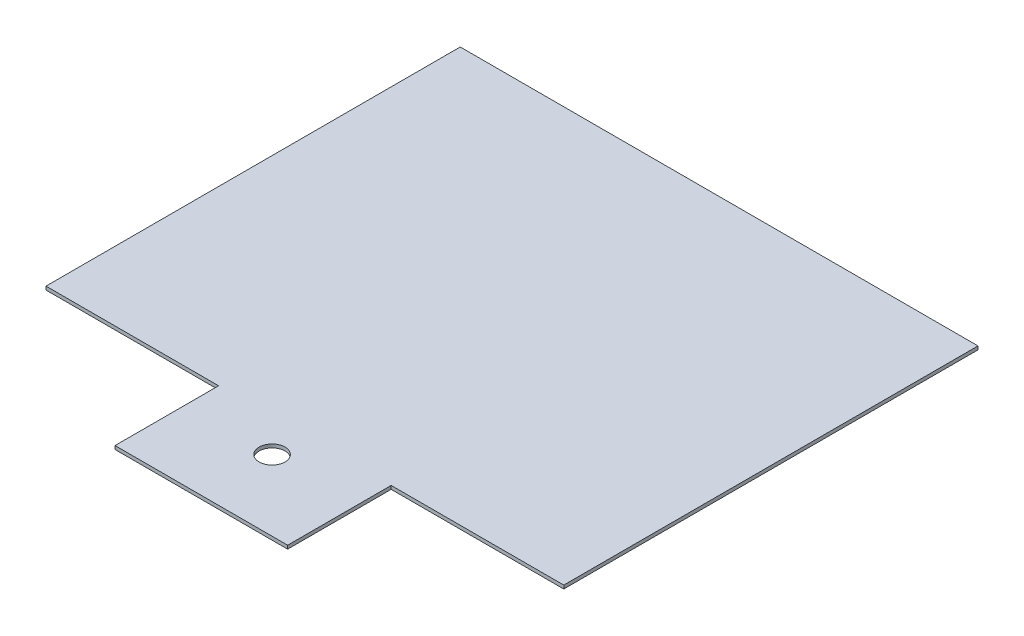
ISO-10303-21;
HEADER;
FILE_DESCRIPTION(('STEP AP214'),'2;1');
FILE_NAME('part.step','',(''),(''),'','','');
FILE_SCHEMA(('AUTOMOTIVE_DESIGN { 1 0 10303 214 1 1 1 1 }'));
ENDSEC;
DATA;
#1=APPLICATION_CONTEXT('core data for automotive mechanical design processes');
#2=APPLICATION_PROTOCOL_DEFINITION('international standard','automotive_design',2000,#1);
#3=PRODUCT_CONTEXT('',#1,'mechanical');
#4=PRODUCT('Part','Part','',(#3));
#5=PRODUCT_RELATED_PRODUCT_CATEGORY('part','',(#4));
#6=PRODUCT_DEFINITION_FORMATION('','',#4);
#7=PRODUCT_DEFINITION_CONTEXT('part definition',#1,'design');
#8=PRODUCT_DEFINITION('design','',#6,#7);
#9=PRODUCT_DEFINITION_SHAPE('','',#8);
#10=(LENGTH_UNIT() NAMED_UNIT(*) SI_UNIT(.MILLI.,.METRE.));
#11=(NAMED_UNIT(*) PLANE_ANGLE_UNIT() SI_UNIT($,.RADIAN.));
#12=(NAMED_UNIT(*) SI_UNIT($,.STERADIAN.) SOLID_ANGLE_UNIT());
#13=UNCERTAINTY_MEASURE_WITH_UNIT(LENGTH_MEASURE(1.E-05),#10,'distance_accuracy_value','');
#14=(GEOMETRIC_REPRESENTATION_CONTEXT(3) GLOBAL_UNCERTAINTY_ASSIGNED_CONTEXT((#13)) GLOBAL_UNIT_ASSIGNED_CONTEXT((#10,
#11,#12)) REPRESENTATION_CONTEXT('',''));
#15=CARTESIAN_POINT('',(0.,0.,0.));
#16=DIRECTION('',(0.,0.,1.));
#17=DIRECTION('',(1.,0.,0.));
#18=AXIS2_PLACEMENT_3D('',#15,#16,#17);
#19=CARTESIAN_POINT('',(-50.,2.,-250.));
#20=DIRECTION('',(0.,0.,1.));
#21=DIRECTION('',(1.,0.,0.));
#22=AXIS2_PLACEMENT_3D('',#19,#20,#21);
#23=PLANE('',#22);
#24=DIRECTION('',(-1.,0.,0.));
#25=VECTOR('',#24,1.);
#26=CARTESIAN_POINT('',(-50.,0.,-250.));
#27=LINE('',#26,#25);
#28=CARTESIAN_POINT('',(150.,0.,-250.));
#29=VERTEX_POINT('',#28);
#30=CARTESIAN_POINT('',(-150.,0.,-250.));
#31=VERTEX_POINT('',#30);
#32=EDGE_CURVE('E85',#29,#31,#27,.T.);
#33=ORIENTED_EDGE('',*,*,#32,.T.);
#34=DIRECTION('',(0.,-1.,0.));
#35=VECTOR('',#34,1.);
#36=CARTESIAN_POINT('',(-150.,2.,-250.));
#37=LINE('',#36,#35);
#38=CARTESIAN_POINT('',(-150.,2.,-250.));
#39=VERTEX_POINT('',#38);
#40=EDGE_CURVE('E11',#39,#31,#37,.T.);
#41=ORIENTED_EDGE('',*,*,#40,.F.);
#42=DIRECTION('',(-1.,0.,0.));
#43=VECTOR('',#42,1.);
#44=CARTESIAN_POINT('',(150.,2.,-250.));
#45=LINE('',#44,#43);
#46=CARTESIAN_POINT('',(150.,2.,-250.));
#47=VERTEX_POINT('',#46);
#48=EDGE_CURVE('E91',#47,#39,#45,.T.);
#49=ORIENTED_EDGE('',*,*,#48,.F.);
#50=DIRECTION('',(0.,-1.,0.));
#51=VECTOR('',#50,1.);
#52=CARTESIAN_POINT('',(150.,2.,-250.));
#53=LINE('',#52,#51);
#54=EDGE_CURVE('E125',#47,#29,#53,.T.);
#55=ORIENTED_EDGE('',*,*,#54,.T.);
#56=EDGE_LOOP('',(#33,#41,#49,#55));
#57=FACE_BOUND('',#56,.T.);
#58=ADVANCED_FACE('F33',(#57),#23,.F.);
#59=CARTESIAN_POINT('',(-150.,2.,-250.));
#60=DIRECTION('',(1.,0.,0.));
#61=DIRECTION('',(0.,0.,-1.));
#62=AXIS2_PLACEMENT_3D('',#59,#60,#61);
#63=PLANE('',#62);
#64=DIRECTION('',(0.,0.,1.));
#65=VECTOR('',#64,1.);
#66=CARTESIAN_POINT('',(-150.,0.,-250.));
#67=LINE('',#66,#65);
#68=CARTESIAN_POINT('',(-150.,0.,-9.99999999999995));
#69=VERTEX_POINT('',#68);
#70=EDGE_CURVE('E130',#31,#69,#67,.T.);
#71=ORIENTED_EDGE('',*,*,#70,.T.);
#72=DIRECTION('',(0.,-1.,0.));
#73=VECTOR('',#72,1.);
#74=CARTESIAN_POINT('',(-150.,2.,-9.99999999999995));
#75=LINE('',#74,#73);
#76=CARTESIAN_POINT('',(-150.,2.,-9.99999999999995));
#77=VERTEX_POINT('',#76);
#78=EDGE_CURVE('E41',#77,#69,#75,.T.);
#79=ORIENTED_EDGE('',*,*,#78,.F.);
#80=DIRECTION('',(0.,0.,1.));
#81=VECTOR('',#80,1.);
#82=CARTESIAN_POINT('',(-150.,2.,-250.));
#83=LINE('',#82,#81);
#84=EDGE_CURVE('E175',#39,#77,#83,.T.);
#85=ORIENTED_EDGE('',*,*,#84,.F.);
#86=ORIENTED_EDGE('',*,*,#40,.T.);
#87=EDGE_LOOP('',(#71,#79,#85,#86));
#88=FACE_BOUND('',#87,.T.);
#89=ADVANCED_FACE('F199',(#88),#63,.F.);
#90=CARTESIAN_POINT('',(-150.,2.,-9.99999999999995));
#91=DIRECTION('',(0.,0.,-1.));
#92=DIRECTION('',(-1.,0.,0.));
#93=AXIS2_PLACEMENT_3D('',#90,#91,#92);
#94=PLANE('',#93);
#95=DIRECTION('',(1.,0.,0.));
#96=VECTOR('',#95,1.);
#97=CARTESIAN_POINT('',(-150.,0.,-9.99999999999995));
#98=LINE('',#97,#96);
#99=CARTESIAN_POINT('',(-50.,0.,-9.99999999999995));
#100=VERTEX_POINT('',#99);
#101=EDGE_CURVE('E133',#69,#100,#98,.T.);
#102=ORIENTED_EDGE('',*,*,#101,.T.);
#103=DIRECTION('',(0.,-1.,0.));
#104=VECTOR('',#103,1.);
#105=CARTESIAN_POINT('',(-50.,2.,-9.99999999999995));
#106=LINE('',#105,#104);
#107=CARTESIAN_POINT('',(-50.,2.,-9.99999999999995));
#108=VERTEX_POINT('',#107);
#109=EDGE_CURVE('E150',#108,#100,#106,.T.);
#110=ORIENTED_EDGE('',*,*,#109,.F.);
#111=DIRECTION('',(1.,0.,0.));
#112=VECTOR('',#111,1.);
#113=CARTESIAN_POINT('',(-150.,2.,-9.99999999999995));
#114=LINE('',#113,#112);
#115=EDGE_CURVE('E159',#77,#108,#114,.T.);
#116=ORIENTED_EDGE('',*,*,#115,.F.);
#117=ORIENTED_EDGE('',*,*,#78,.T.);
#118=EDGE_LOOP('',(#102,#110,#116,#117));
#119=FACE_BOUND('',#118,.T.);
#120=ADVANCED_FACE('F157',(#119),#94,.F.);
#121=CARTESIAN_POINT('',(-50.,2.,50.));
#122=DIRECTION('',(1.,0.,0.));
#123=DIRECTION('',(0.,0.,-1.));
#124=AXIS2_PLACEMENT_3D('',#121,#122,#123);
#125=PLANE('',#124);
#126=DIRECTION('',(0.,0.,1.));
#127=VECTOR('',#126,1.);
#128=CARTESIAN_POINT('',(-50.,0.,50.));
#129=LINE('',#128,#127);
#130=CARTESIAN_POINT('',(-50.,0.,50.));
#131=VERTEX_POINT('',#130);
#132=EDGE_CURVE('E135',#100,#131,#129,.T.);
#133=ORIENTED_EDGE('',*,*,#132,.T.);
#134=DIRECTION('',(0.,-1.,0.));
#135=VECTOR('',#134,1.);
#136=CARTESIAN_POINT('',(-50.,2.,50.));
#137=LINE('',#136,#135);
#138=CARTESIAN_POINT('',(-50.,2.,50.));
#139=VERTEX_POINT('',#138);
#140=EDGE_CURVE('E147',#139,#131,#137,.T.);
#141=ORIENTED_EDGE('',*,*,#140,.F.);
#142=DIRECTION('',(0.,0.,1.));
#143=VECTOR('',#142,1.);
#144=CARTESIAN_POINT('',(-50.,2.,50.));
#145=LINE('',#144,#143);
#146=EDGE_CURVE('E171',#108,#139,#145,.T.);
#147=ORIENTED_EDGE('',*,*,#146,.F.);
#148=ORIENTED_EDGE('',*,*,#109,.T.);
#149=EDGE_LOOP('',(#133,#141,#147,#148));
#150=FACE_BOUND('',#149,.T.);
#151=ADVANCED_FACE('F167',(#150),#125,.F.);
#152=CARTESIAN_POINT('',(-50.,2.,50.));
#153=DIRECTION('',(0.,0.,-1.));
#154=DIRECTION('',(-1.,0.,0.));
#155=AXIS2_PLACEMENT_3D('',#152,#153,#154);
#156=PLANE('',#155);
#157=DIRECTION('',(1.,0.,0.));
#158=VECTOR('',#157,1.);
#159=CARTESIAN_POINT('',(-50.,0.,50.));
#160=LINE('',#159,#158);
#161=CARTESIAN_POINT('',(50.,0.,50.));
#162=VERTEX_POINT('',#161);
#163=EDGE_CURVE('E137',#131,#162,#160,.T.);
#164=ORIENTED_EDGE('',*,*,#163,.T.);
#165=DIRECTION('',(0.,-1.,0.));
#166=VECTOR('',#165,1.);
#167=CARTESIAN_POINT('',(50.,2.,50.));
#168=LINE('',#167,#166);
#169=CARTESIAN_POINT('',(50.,2.,50.));
#170=VERTEX_POINT('',#169);
#171=EDGE_CURVE('E120',#170,#162,#168,.T.);
#172=ORIENTED_EDGE('',*,*,#171,.F.);
#173=DIRECTION('',(1.,0.,0.));
#174=VECTOR('',#173,1.);
#175=CARTESIAN_POINT('',(-50.,2.,50.));
#176=LINE('',#175,#174);
#177=EDGE_CURVE('E111',#139,#170,#176,.T.);
#178=ORIENTED_EDGE('',*,*,#177,.F.);
#179=ORIENTED_EDGE('',*,*,#140,.T.);
#180=EDGE_LOOP('',(#164,#172,#178,#179));
#181=FACE_BOUND('',#180,.T.);
#182=ADVANCED_FACE('F170',(#181),#156,.F.);
#183=CARTESIAN_POINT('',(50.,2.,50.));
#184=DIRECTION('',(-1.,0.,0.));
#185=DIRECTION('',(0.,0.,1.));
#186=AXIS2_PLACEMENT_3D('',#183,#184,#185);
#187=PLANE('',#186);
#188=DIRECTION('',(0.,0.,-1.));
#189=VECTOR('',#188,1.);
#190=CARTESIAN_POINT('',(50.,0.,50.));
#191=LINE('',#190,#189);
#192=CARTESIAN_POINT('',(50.,0.,-9.99999999999995));
#193=VERTEX_POINT('',#192);
#194=EDGE_CURVE('E119',#162,#193,#191,.T.);
#195=ORIENTED_EDGE('',*,*,#194,.T.);
#196=DIRECTION('',(0.,-1.,0.));
#197=VECTOR('',#196,1.);
#198=CARTESIAN_POINT('',(50.,2.,-9.99999999999995));
#199=LINE('',#198,#197);
#200=CARTESIAN_POINT('',(50.,2.,-9.99999999999995));
#201=VERTEX_POINT('',#200);
#202=EDGE_CURVE('E116',#201,#193,#199,.T.);
#203=ORIENTED_EDGE('',*,*,#202,.F.);
#204=DIRECTION('',(0.,0.,-1.));
#205=VECTOR('',#204,1.);
#206=CARTESIAN_POINT('',(50.,2.,50.));
#207=LINE('',#206,#205);
#208=EDGE_CURVE('E105',#170,#201,#207,.T.);
#209=ORIENTED_EDGE('',*,*,#208,.F.);
#210=ORIENTED_EDGE('',*,*,#171,.T.);
#211=EDGE_LOOP('',(#195,#203,#209,#210));
#212=FACE_BOUND('',#211,.T.);
#213=ADVANCED_FACE('F117',(#212),#187,.F.);
#214=CARTESIAN_POINT('',(50.,2.,-9.99999999999995));
#215=DIRECTION('',(0.,0.,-1.));
#216=DIRECTION('',(-1.,0.,0.));
#217=AXIS2_PLACEMENT_3D('',#214,#215,#216);
#218=PLANE('',#217);
#219=DIRECTION('',(1.,0.,0.));
#220=VECTOR('',#219,1.);
#221=CARTESIAN_POINT('',(50.,0.,-9.99999999999995));
#222=LINE('',#221,#220);
#223=CARTESIAN_POINT('',(150.,0.,-9.99999999999995));
#224=VERTEX_POINT('',#223);
#225=EDGE_CURVE('E78',#193,#224,#222,.T.);
#226=ORIENTED_EDGE('',*,*,#225,.T.);
#227=DIRECTION('',(0.,-1.,0.));
#228=VECTOR('',#227,1.);
#229=CARTESIAN_POINT('',(150.,2.,-9.99999999999995));
#230=LINE('',#229,#228);
#231=CARTESIAN_POINT('',(150.,2.,-9.99999999999995));
#232=VERTEX_POINT('',#231);
#233=EDGE_CURVE('E121',#232,#224,#230,.T.);
#234=ORIENTED_EDGE('',*,*,#233,.F.);
#235=DIRECTION('',(1.,0.,0.));
#236=VECTOR('',#235,1.);
#237=CARTESIAN_POINT('',(50.,2.,-9.99999999999995));
#238=LINE('',#237,#236);
#239=EDGE_CURVE('E109',#201,#232,#238,.T.);
#240=ORIENTED_EDGE('',*,*,#239,.F.);
#241=ORIENTED_EDGE('',*,*,#202,.T.);
#242=EDGE_LOOP('',(#226,#234,#240,#241));
#243=FACE_BOUND('',#242,.T.);
#244=ADVANCED_FACE('F123',(#243),#218,.F.);
#245=CARTESIAN_POINT('',(150.,2.,-9.99999999999995));
#246=DIRECTION('',(-1.,0.,0.));
#247=DIRECTION('',(0.,0.,1.));
#248=AXIS2_PLACEMENT_3D('',#245,#246,#247);
#249=PLANE('',#248);
#250=DIRECTION('',(0.,0.,-1.));
#251=VECTOR('',#250,1.);
#252=CARTESIAN_POINT('',(150.,0.,-9.99999999999995));
#253=LINE('',#252,#251);
#254=EDGE_CURVE('E141',#224,#29,#253,.T.);
#255=ORIENTED_EDGE('',*,*,#254,.T.);
#256=ORIENTED_EDGE('',*,*,#54,.F.);
#257=DIRECTION('',(0.,0.,-1.));
#258=VECTOR('',#257,1.);
#259=CARTESIAN_POINT('',(150.,2.,-9.99999999999995));
#260=LINE('',#259,#258);
#261=EDGE_CURVE('E49',#232,#47,#260,.T.);
#262=ORIENTED_EDGE('',*,*,#261,.F.);
#263=ORIENTED_EDGE('',*,*,#233,.T.);
#264=EDGE_LOOP('',(#255,#256,#262,#263));
#265=FACE_BOUND('',#264,.T.);
#266=ADVANCED_FACE('F194',(#265),#249,.F.);
#267=CARTESIAN_POINT('',(0.,2.,0.));
#268=DIRECTION('',(0.,1.,0.));
#269=DIRECTION('',(0.,0.,1.));
#270=AXIS2_PLACEMENT_3D('',#267,#268,#269);
#271=PLANE('',#270);
#272=CARTESIAN_POINT('',(-3.33066907387547E-13,2.,9.00000000000034));
#273=DIRECTION('',(0.,1.,0.));
#274=DIRECTION('',(0.,0.,1.));
#275=AXIS2_PLACEMENT_3D('',#272,#273,#274);
#276=CIRCLE('',#275,7.5);
#277=CARTESIAN_POINT('',(-3.33066907387547E-13,2.,16.5000000000003));
#278=VERTEX_POINT('',#277);
#279=EDGE_CURVE('E131',#278,#278,#276,.T.);
#280=ORIENTED_EDGE('',*,*,#279,.F.);
#281=EDGE_LOOP('',(#280));
#282=FACE_BOUND('',#281,.T.);
#283=ORIENTED_EDGE('',*,*,#48,.T.);
#284=ORIENTED_EDGE('',*,*,#84,.T.);
#285=ORIENTED_EDGE('',*,*,#115,.T.);
#286=ORIENTED_EDGE('',*,*,#146,.T.);
#287=ORIENTED_EDGE('',*,*,#177,.T.);
#288=ORIENTED_EDGE('',*,*,#208,.T.);
#289=ORIENTED_EDGE('',*,*,#239,.T.);
#290=ORIENTED_EDGE('',*,*,#261,.T.);
#291=EDGE_LOOP('',(#283,#284,#285,#286,#287,#288,#289,#290));
#292=FACE_BOUND('',#291,.T.);
#293=ADVANCED_FACE('F107',(#282,#292),#271,.T.);
#294=CARTESIAN_POINT('',(0.,0.,0.));
#295=DIRECTION('',(0.,1.,0.));
#296=DIRECTION('',(0.,0.,1.));
#297=AXIS2_PLACEMENT_3D('',#294,#295,#296);
#298=PLANE('',#297);
#299=CARTESIAN_POINT('',(-3.33066907387547E-13,0.,9.00000000000034));
#300=DIRECTION('',(0.,-1.,0.));
#301=DIRECTION('',(0.,0.,-1.));
#302=AXIS2_PLACEMENT_3D('',#299,#300,#301);
#303=CIRCLE('',#302,7.5);
#304=CARTESIAN_POINT('',(-3.33066907387547E-13,0.,1.50000000000035));
#305=VERTEX_POINT('',#304);
#306=EDGE_CURVE('E180',#305,#305,#303,.T.);
#307=ORIENTED_EDGE('',*,*,#306,.F.);
#308=EDGE_LOOP('',(#307));
#309=FACE_BOUND('',#308,.T.);
#310=ORIENTED_EDGE('',*,*,#32,.F.);
#311=ORIENTED_EDGE('',*,*,#254,.F.);
#312=ORIENTED_EDGE('',*,*,#225,.F.);
#313=ORIENTED_EDGE('',*,*,#194,.F.);
#314=ORIENTED_EDGE('',*,*,#163,.F.);
#315=ORIENTED_EDGE('',*,*,#132,.F.);
#316=ORIENTED_EDGE('',*,*,#101,.F.);
#317=ORIENTED_EDGE('',*,*,#70,.F.);
#318=EDGE_LOOP('',(#310,#311,#312,#313,#314,#315,#316,#317));
#319=FACE_BOUND('',#318,.T.);
#320=ADVANCED_FACE('F163',(#309,#319),#298,.F.);
#321=CARTESIAN_POINT('',(-3.33066907387547E-13,10.,9.00000000000034));
#322=DIRECTION('',(0.,-1.,0.));
#323=DIRECTION('',(0.,0.,-1.));
#324=AXIS2_PLACEMENT_3D('',#321,#322,#323);
#325=CYLINDRICAL_SURFACE('',#324,7.5);
#326=ORIENTED_EDGE('',*,*,#279,.T.);
#327=EDGE_LOOP('',(#326));
#328=FACE_BOUND('',#327,.T.);
#329=ORIENTED_EDGE('',*,*,#306,.T.);
#330=EDGE_LOOP('',(#329));
#331=FACE_BOUND('',#330,.T.);
#332=ADVANCED_FACE('F184',(#328,#331),#325,.F.);
#333=CLOSED_SHELL('',(#58,#89,#120,#151,#182,#213,#244,#266,#293,#320,#332));
#334=MANIFOLD_SOLID_BREP('B2',#333);
#335=ADVANCED_BREP_SHAPE_REPRESENTATION('',(#18,#334),#14);
#336=SHAPE_DEFINITION_REPRESENTATION(#9,#335);
ENDSEC;
END-ISO-10303-21;
